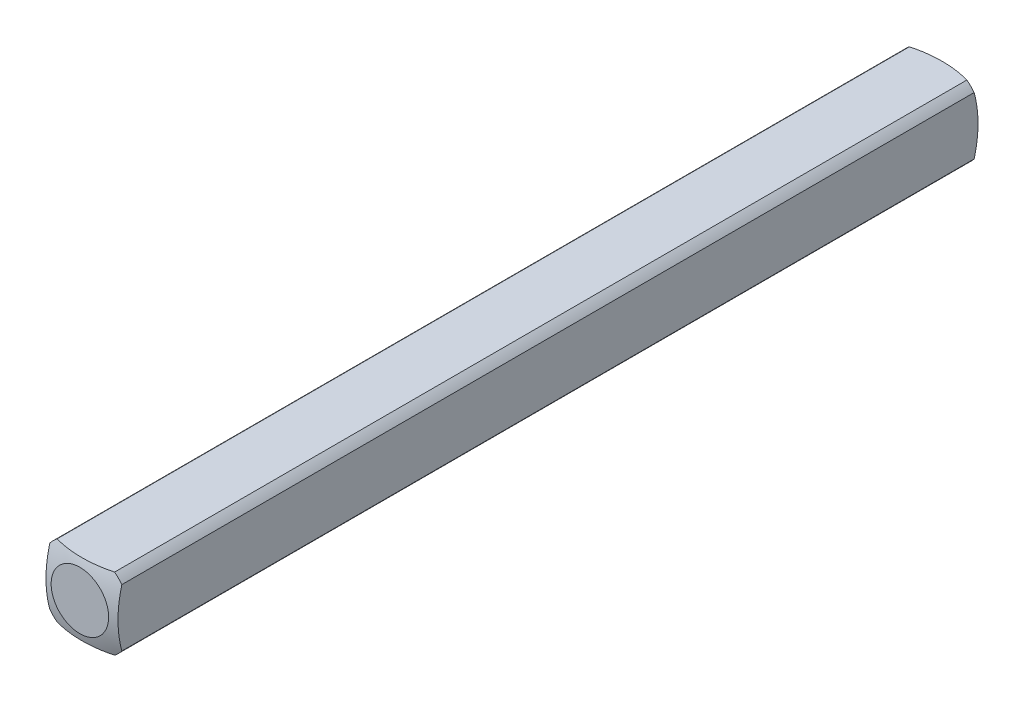
ISO-10303-21;
HEADER;
FILE_DESCRIPTION(('STEP AP214'),'2;1');
FILE_NAME('part.step','',(''),(''),'','','');
FILE_SCHEMA(('AUTOMOTIVE_DESIGN { 1 0 10303 214 1 1 1 1 }'));
ENDSEC;
DATA;
#1=APPLICATION_CONTEXT('core data for automotive mechanical design processes');
#2=APPLICATION_PROTOCOL_DEFINITION('international standard','automotive_design',2000,#1);
#3=PRODUCT_CONTEXT('',#1,'mechanical');
#4=PRODUCT('Part','Part','',(#3));
#5=PRODUCT_RELATED_PRODUCT_CATEGORY('part','',(#4));
#6=PRODUCT_DEFINITION_FORMATION('','',#4);
#7=PRODUCT_DEFINITION_CONTEXT('part definition',#1,'design');
#8=PRODUCT_DEFINITION('design','',#6,#7);
#9=PRODUCT_DEFINITION_SHAPE('','',#8);
#10=(LENGTH_UNIT() NAMED_UNIT(*) SI_UNIT(.MILLI.,.METRE.));
#11=(NAMED_UNIT(*) PLANE_ANGLE_UNIT() SI_UNIT($,.RADIAN.));
#12=(NAMED_UNIT(*) SI_UNIT($,.STERADIAN.) SOLID_ANGLE_UNIT());
#13=UNCERTAINTY_MEASURE_WITH_UNIT(LENGTH_MEASURE(1.E-05),#10,'distance_accuracy_value','');
#14=(GEOMETRIC_REPRESENTATION_CONTEXT(3) GLOBAL_UNCERTAINTY_ASSIGNED_CONTEXT((#13)) GLOBAL_UNIT_ASSIGNED_CONTEXT((#10,
#11,#12)) REPRESENTATION_CONTEXT('',''));
#15=CARTESIAN_POINT('',(0.,0.,0.));
#16=DIRECTION('',(0.,0.,1.));
#17=DIRECTION('',(1.,0.,0.));
#18=AXIS2_PLACEMENT_3D('',#15,#16,#17);
#19=CARTESIAN_POINT('',(-1.5875,-1.5875,19.05));
#20=DIRECTION('',(1.,0.,0.));
#21=DIRECTION('',(0.,0.,-1.));
#22=AXIS2_PLACEMENT_3D('',#19,#20,#21);
#23=PLANE('',#22);
#24=CARTESIAN_POINT('',(-1.5875,0.,4.91912226376204));
#25=DIRECTION('',(1.,0.,0.));
#26=DIRECTION('',(0.,0.,-1.));
#27=AXIS2_PLACEMENT_3D('',#24,#25,#26);
#28=CIRCLE('',#27,4.82558221875869);
#29=CARTESIAN_POINT('',(-1.5875,-1.26841150657032,0.263225357686905));
#30=VERTEX_POINT('',#29);
#31=CARTESIAN_POINT('',(-1.5875,1.26841150657032,0.263225357686917));
#32=VERTEX_POINT('',#31);
#33=EDGE_CURVE('E49',#30,#32,#28,.T.);
#34=ORIENTED_EDGE('',*,*,#33,.F.);
#35=DIRECTION('',(0.,0.,-1.));
#36=VECTOR('',#35,1.);
#37=CARTESIAN_POINT('',(-1.5875,-1.26841150657032,19.05));
#38=LINE('',#37,#36);
#39=CARTESIAN_POINT('',(-1.5875,-1.26841150657032,37.8367746423131));
#40=VERTEX_POINT('',#39);
#41=EDGE_CURVE('E42',#40,#30,#38,.T.);
#42=ORIENTED_EDGE('',*,*,#41,.F.);
#43=CARTESIAN_POINT('',(-1.5875,0.,33.180877736238));
#44=DIRECTION('',(-1.,0.,0.));
#45=DIRECTION('',(0.,0.,1.));
#46=AXIS2_PLACEMENT_3D('',#43,#44,#45);
#47=CIRCLE('',#46,4.82558221875869);
#48=CARTESIAN_POINT('',(-1.5875,1.26841150657032,37.8367746423131));
#49=VERTEX_POINT('',#48);
#50=EDGE_CURVE('E125',#40,#49,#47,.T.);
#51=ORIENTED_EDGE('',*,*,#50,.T.);
#52=DIRECTION('',(0.,0.,-1.));
#53=VECTOR('',#52,1.);
#54=CARTESIAN_POINT('',(-1.5875,1.26841150657032,19.05));
#55=LINE('',#54,#53);
#56=EDGE_CURVE('E113',#32,#49,#55,.F.);
#57=ORIENTED_EDGE('',*,*,#56,.F.);
#58=EDGE_LOOP('',(#34,#42,#51,#57));
#59=FACE_BOUND('',#58,.T.);
#60=ADVANCED_FACE('F35',(#59),#23,.F.);
#61=CARTESIAN_POINT('',(-1.5875,-1.5875,19.05));
#62=DIRECTION('',(0.,1.,0.));
#63=DIRECTION('',(0.,0.,1.));
#64=AXIS2_PLACEMENT_3D('',#61,#62,#63);
#65=PLANE('',#64);
#66=CARTESIAN_POINT('',(0.,-1.5875,4.91912226376204));
#67=DIRECTION('',(0.,1.,0.));
#68=DIRECTION('',(0.,0.,1.));
#69=AXIS2_PLACEMENT_3D('',#66,#67,#68);
#70=CIRCLE('',#69,4.82558221875869);
#71=CARTESIAN_POINT('',(1.26841150657032,-1.5875,0.263225357686905));
#72=VERTEX_POINT('',#71);
#73=CARTESIAN_POINT('',(-1.26841150657032,-1.5875,0.263225357686908));
#74=VERTEX_POINT('',#73);
#75=EDGE_CURVE('E154',#72,#74,#70,.T.);
#76=ORIENTED_EDGE('',*,*,#75,.F.);
#77=DIRECTION('',(0.,0.,-1.));
#78=VECTOR('',#77,1.);
#79=CARTESIAN_POINT('',(1.26841150657032,-1.5875,19.05));
#80=LINE('',#79,#78);
#81=CARTESIAN_POINT('',(1.26841150657032,-1.5875,37.8367746423131));
#82=VERTEX_POINT('',#81);
#83=EDGE_CURVE('E167',#82,#72,#80,.T.);
#84=ORIENTED_EDGE('',*,*,#83,.F.);
#85=CARTESIAN_POINT('',(0.,-1.5875,33.180877736238));
#86=DIRECTION('',(0.,-1.,0.));
#87=DIRECTION('',(0.,0.,-1.));
#88=AXIS2_PLACEMENT_3D('',#85,#86,#87);
#89=CIRCLE('',#88,4.82558221875869);
#90=CARTESIAN_POINT('',(-1.26841150657032,-1.5875,37.8367746423131));
#91=VERTEX_POINT('',#90);
#92=EDGE_CURVE('E136',#82,#91,#89,.T.);
#93=ORIENTED_EDGE('',*,*,#92,.T.);
#94=DIRECTION('',(0.,0.,-1.));
#95=VECTOR('',#94,1.);
#96=CARTESIAN_POINT('',(-1.26841150657032,-1.5875,19.05));
#97=LINE('',#96,#95);
#98=EDGE_CURVE('E165',#74,#91,#97,.F.);
#99=ORIENTED_EDGE('',*,*,#98,.F.);
#100=EDGE_LOOP('',(#76,#84,#93,#99));
#101=FACE_BOUND('',#100,.T.);
#102=ADVANCED_FACE('F177',(#101),#65,.F.);
#103=CARTESIAN_POINT('',(1.5875,-1.5875,19.05));
#104=DIRECTION('',(-1.,0.,0.));
#105=DIRECTION('',(0.,0.,1.));
#106=AXIS2_PLACEMENT_3D('',#103,#104,#105);
#107=PLANE('',#106);
#108=CARTESIAN_POINT('',(1.5875,0.,4.91912226376204));
#109=DIRECTION('',(-1.,0.,0.));
#110=DIRECTION('',(0.,0.,1.));
#111=AXIS2_PLACEMENT_3D('',#108,#109,#110);
#112=CIRCLE('',#111,4.82558221875869);
#113=CARTESIAN_POINT('',(1.5875,1.26841150657032,0.263225357686908));
#114=VERTEX_POINT('',#113);
#115=CARTESIAN_POINT('',(1.5875,-1.26841150657032,0.263225357686905));
#116=VERTEX_POINT('',#115);
#117=EDGE_CURVE('E152',#114,#116,#112,.T.);
#118=ORIENTED_EDGE('',*,*,#117,.F.);
#119=DIRECTION('',(0.,0.,-1.));
#120=VECTOR('',#119,1.);
#121=CARTESIAN_POINT('',(1.5875,1.26841150657032,19.05));
#122=LINE('',#121,#120);
#123=CARTESIAN_POINT('',(1.5875,1.26841150657032,37.8367746423131));
#124=VERTEX_POINT('',#123);
#125=EDGE_CURVE('E162',#124,#114,#122,.T.);
#126=ORIENTED_EDGE('',*,*,#125,.F.);
#127=CARTESIAN_POINT('',(1.5875,0.,33.180877736238));
#128=DIRECTION('',(1.,0.,0.));
#129=DIRECTION('',(0.,0.,-1.));
#130=AXIS2_PLACEMENT_3D('',#127,#128,#129);
#131=CIRCLE('',#130,4.82558221875869);
#132=CARTESIAN_POINT('',(1.5875,-1.26841150657032,37.8367746423131));
#133=VERTEX_POINT('',#132);
#134=EDGE_CURVE('E133',#124,#133,#131,.T.);
#135=ORIENTED_EDGE('',*,*,#134,.T.);
#136=DIRECTION('',(0.,0.,-1.));
#137=VECTOR('',#136,1.);
#138=CARTESIAN_POINT('',(1.5875,-1.26841150657032,19.05));
#139=LINE('',#138,#137);
#140=EDGE_CURVE('E106',#116,#133,#139,.F.);
#141=ORIENTED_EDGE('',*,*,#140,.F.);
#142=EDGE_LOOP('',(#118,#126,#135,#141));
#143=FACE_BOUND('',#142,.T.);
#144=ADVANCED_FACE('F184',(#143),#107,.F.);
#145=CARTESIAN_POINT('',(-1.5875,1.5875,19.05));
#146=DIRECTION('',(0.,-1.,0.));
#147=DIRECTION('',(0.,0.,-1.));
#148=AXIS2_PLACEMENT_3D('',#145,#146,#147);
#149=PLANE('',#148);
#150=CARTESIAN_POINT('',(0.,1.5875,4.91912226376204));
#151=DIRECTION('',(0.,-1.,0.));
#152=DIRECTION('',(0.,0.,-1.));
#153=AXIS2_PLACEMENT_3D('',#150,#151,#152);
#154=CIRCLE('',#153,4.82558221875869);
#155=CARTESIAN_POINT('',(-1.26841150657032,1.5875,0.263225357686908));
#156=VERTEX_POINT('',#155);
#157=CARTESIAN_POINT('',(1.26841150657032,1.5875,0.263225357686905));
#158=VERTEX_POINT('',#157);
#159=EDGE_CURVE('E104',#156,#158,#154,.T.);
#160=ORIENTED_EDGE('',*,*,#159,.F.);
#161=DIRECTION('',(0.,0.,-1.));
#162=VECTOR('',#161,1.);
#163=CARTESIAN_POINT('',(-1.26841150657032,1.5875,19.05));
#164=LINE('',#163,#162);
#165=CARTESIAN_POINT('',(-1.26841150657032,1.5875,37.8367746423131));
#166=VERTEX_POINT('',#165);
#167=EDGE_CURVE('E98',#166,#156,#164,.T.);
#168=ORIENTED_EDGE('',*,*,#167,.F.);
#169=CARTESIAN_POINT('',(0.,1.5875,33.180877736238));
#170=DIRECTION('',(0.,1.,0.));
#171=DIRECTION('',(0.,0.,1.));
#172=AXIS2_PLACEMENT_3D('',#169,#170,#171);
#173=CIRCLE('',#172,4.82558221875869);
#174=CARTESIAN_POINT('',(1.26841150657032,1.5875,37.8367746423131));
#175=VERTEX_POINT('',#174);
#176=EDGE_CURVE('E103',#166,#175,#173,.T.);
#177=ORIENTED_EDGE('',*,*,#176,.T.);
#178=DIRECTION('',(0.,0.,-1.));
#179=VECTOR('',#178,1.);
#180=CARTESIAN_POINT('',(1.26841150657032,1.5875,19.05));
#181=LINE('',#180,#179);
#182=EDGE_CURVE('E107',#158,#175,#181,.F.);
#183=ORIENTED_EDGE('',*,*,#182,.F.);
#184=EDGE_LOOP('',(#160,#168,#177,#183));
#185=FACE_BOUND('',#184,.T.);
#186=ADVANCED_FACE('F100',(#185),#149,.F.);
#187=CARTESIAN_POINT('',(0.,0.,19.05));
#188=DIRECTION('',(0.,0.,-1.));
#189=DIRECTION('',(-1.,0.,0.));
#190=AXIS2_PLACEMENT_3D('',#187,#188,#189);
#191=CYLINDRICAL_SURFACE('',#190,2.032);
#192=ORIENTED_EDGE('',*,*,#41,.T.);
#193=CARTESIAN_POINT('',(0.,0.,0.263225357686908));
#194=DIRECTION('',(0.,0.,1.));
#195=DIRECTION('',(1.,0.,0.));
#196=AXIS2_PLACEMENT_3D('',#193,#194,#195);
#197=CIRCLE('',#196,2.032);
#198=EDGE_CURVE('E149',#30,#74,#197,.T.);
#199=ORIENTED_EDGE('',*,*,#198,.T.);
#200=ORIENTED_EDGE('',*,*,#98,.T.);
#201=CARTESIAN_POINT('',(0.,0.,37.8367746423131));
#202=DIRECTION('',(0.,0.,1.));
#203=DIRECTION('',(1.,0.,0.));
#204=AXIS2_PLACEMENT_3D('',#201,#202,#203);
#205=CIRCLE('',#204,2.032);
#206=EDGE_CURVE('E130',#40,#91,#205,.T.);
#207=ORIENTED_EDGE('',*,*,#206,.F.);
#208=EDGE_LOOP('',(#192,#199,#200,#207));
#209=FACE_BOUND('',#208,.T.);
#210=ADVANCED_FACE('F173',(#209),#191,.T.);
#211=ORIENTED_EDGE('',*,*,#83,.T.);
#212=CARTESIAN_POINT('',(0.,0.,0.263225357686908));
#213=DIRECTION('',(0.,0.,1.));
#214=DIRECTION('',(1.,0.,0.));
#215=AXIS2_PLACEMENT_3D('',#212,#213,#214);
#216=CIRCLE('',#215,2.032);
#217=EDGE_CURVE('E55',#72,#116,#216,.T.);
#218=ORIENTED_EDGE('',*,*,#217,.T.);
#219=ORIENTED_EDGE('',*,*,#140,.T.);
#220=CARTESIAN_POINT('',(0.,0.,37.8367746423131));
#221=DIRECTION('',(0.,0.,1.));
#222=DIRECTION('',(1.,0.,0.));
#223=AXIS2_PLACEMENT_3D('',#220,#221,#222);
#224=CIRCLE('',#223,2.032);
#225=EDGE_CURVE('E139',#82,#133,#224,.T.);
#226=ORIENTED_EDGE('',*,*,#225,.F.);
#227=EDGE_LOOP('',(#211,#218,#219,#226));
#228=FACE_BOUND('',#227,.T.);
#229=ADVANCED_FACE('F180',(#228),#191,.T.);
#230=ORIENTED_EDGE('',*,*,#125,.T.);
#231=CARTESIAN_POINT('',(0.,0.,0.263225357686908));
#232=DIRECTION('',(0.,0.,1.));
#233=DIRECTION('',(1.,0.,0.));
#234=AXIS2_PLACEMENT_3D('',#231,#232,#233);
#235=CIRCLE('',#234,2.032);
#236=EDGE_CURVE('E146',#114,#158,#235,.T.);
#237=ORIENTED_EDGE('',*,*,#236,.T.);
#238=ORIENTED_EDGE('',*,*,#182,.T.);
#239=CARTESIAN_POINT('',(0.,0.,37.8367746423131));
#240=DIRECTION('',(0.,0.,1.));
#241=DIRECTION('',(1.,0.,0.));
#242=AXIS2_PLACEMENT_3D('',#239,#240,#241);
#243=CIRCLE('',#242,2.032);
#244=EDGE_CURVE('E124',#124,#175,#243,.T.);
#245=ORIENTED_EDGE('',*,*,#244,.F.);
#246=EDGE_LOOP('',(#230,#237,#238,#245));
#247=FACE_BOUND('',#246,.T.);
#248=ADVANCED_FACE('F186',(#247),#191,.T.);
#249=ORIENTED_EDGE('',*,*,#167,.T.);
#250=CARTESIAN_POINT('',(0.,0.,0.263225357686908));
#251=DIRECTION('',(0.,0.,1.));
#252=DIRECTION('',(1.,0.,0.));
#253=AXIS2_PLACEMENT_3D('',#250,#251,#252);
#254=CIRCLE('',#253,2.032);
#255=EDGE_CURVE('E12',#156,#32,#254,.T.);
#256=ORIENTED_EDGE('',*,*,#255,.T.);
#257=ORIENTED_EDGE('',*,*,#56,.T.);
#258=CARTESIAN_POINT('',(0.,0.,37.8367746423131));
#259=DIRECTION('',(0.,0.,1.));
#260=DIRECTION('',(1.,0.,0.));
#261=AXIS2_PLACEMENT_3D('',#258,#259,#260);
#262=CIRCLE('',#261,2.032);
#263=EDGE_CURVE('E110',#166,#49,#262,.T.);
#264=ORIENTED_EDGE('',*,*,#263,.F.);
#265=EDGE_LOOP('',(#249,#256,#257,#264));
#266=FACE_BOUND('',#265,.T.);
#267=ADVANCED_FACE('F111',(#266),#191,.T.);
#268=CARTESIAN_POINT('',(0.,0.,4.91912226376204));
#269=DIRECTION('',(0.,0.,1.));
#270=DIRECTION('',(-1.,0.,0.));
#271=AXIS2_PLACEMENT_3D('',#268,#269,#270);
#272=SPHERICAL_SURFACE('',#271,5.08);
#273=CARTESIAN_POINT('',(0.,0.,0.));
#274=DIRECTION('',(0.,0.,-1.));
#275=DIRECTION('',(-1.,0.,0.));
#276=AXIS2_PLACEMENT_3D('',#273,#274,#275);
#277=CIRCLE('',#276,1.26832020963187);
#278=CARTESIAN_POINT('',(-1.26832020963187,0.,0.));
#279=VERTEX_POINT('',#278);
#280=EDGE_CURVE('E157',#279,#279,#277,.T.);
#281=ORIENTED_EDGE('',*,*,#280,.F.);
#282=EDGE_LOOP('',(#281));
#283=FACE_BOUND('',#282,.T.);
#284=ORIENTED_EDGE('',*,*,#75,.T.);
#285=ORIENTED_EDGE('',*,*,#198,.F.);
#286=ORIENTED_EDGE('',*,*,#33,.T.);
#287=ORIENTED_EDGE('',*,*,#255,.F.);
#288=ORIENTED_EDGE('',*,*,#159,.T.);
#289=ORIENTED_EDGE('',*,*,#236,.F.);
#290=ORIENTED_EDGE('',*,*,#117,.T.);
#291=ORIENTED_EDGE('',*,*,#217,.F.);
#292=EDGE_LOOP('',(#284,#285,#286,#287,#288,#289,#290,#291));
#293=FACE_BOUND('',#292,.T.);
#294=ADVANCED_FACE('F187',(#283,#293),#272,.T.);
#295=CARTESIAN_POINT('',(0.,0.,0.));
#296=DIRECTION('',(0.,0.,-1.));
#297=DIRECTION('',(-1.,0.,0.));
#298=AXIS2_PLACEMENT_3D('',#295,#296,#297);
#299=PLANE('',#298);
#300=ORIENTED_EDGE('',*,*,#280,.T.);
#301=EDGE_LOOP('',(#300));
#302=FACE_BOUND('',#301,.T.);
#303=ADVANCED_FACE('F189',(#302),#299,.T.);
#304=CARTESIAN_POINT('',(0.,0.,33.180877736238));
#305=DIRECTION('',(0.,0.,-1.));
#306=DIRECTION('',(-1.,0.,0.));
#307=AXIS2_PLACEMENT_3D('',#304,#305,#306);
#308=SPHERICAL_SURFACE('',#307,5.08);
#309=CARTESIAN_POINT('',(0.,0.,38.1));
#310=DIRECTION('',(0.,0.,-1.));
#311=DIRECTION('',(-1.,0.,0.));
#312=AXIS2_PLACEMENT_3D('',#309,#310,#311);
#313=CIRCLE('',#312,1.26832020963187);
#314=CARTESIAN_POINT('',(-1.26832020963187,0.,38.1));
#315=VERTEX_POINT('',#314);
#316=EDGE_CURVE('E117',#315,#315,#313,.T.);
#317=ORIENTED_EDGE('',*,*,#316,.T.);
#318=EDGE_LOOP('',(#317));
#319=FACE_BOUND('',#318,.T.);
#320=ORIENTED_EDGE('',*,*,#92,.F.);
#321=ORIENTED_EDGE('',*,*,#225,.T.);
#322=ORIENTED_EDGE('',*,*,#134,.F.);
#323=ORIENTED_EDGE('',*,*,#244,.T.);
#324=ORIENTED_EDGE('',*,*,#176,.F.);
#325=ORIENTED_EDGE('',*,*,#263,.T.);
#326=ORIENTED_EDGE('',*,*,#50,.F.);
#327=ORIENTED_EDGE('',*,*,#206,.T.);
#328=EDGE_LOOP('',(#320,#321,#322,#323,#324,#325,#326,#327));
#329=FACE_BOUND('',#328,.T.);
#330=ADVANCED_FACE('F121',(#319,#329),#308,.T.);
#331=CARTESIAN_POINT('',(0.,0.,38.1));
#332=DIRECTION('',(0.,0.,1.));
#333=DIRECTION('',(-1.,0.,0.));
#334=AXIS2_PLACEMENT_3D('',#331,#332,#333);
#335=PLANE('',#334);
#336=ORIENTED_EDGE('',*,*,#316,.F.);
#337=EDGE_LOOP('',(#336));
#338=FACE_BOUND('',#337,.T.);
#339=ADVANCED_FACE('F234',(#338),#335,.T.);
#340=CLOSED_SHELL('',(#60,#102,#144,#186,#210,#229,#248,#267,#294,#303,#330,#339));
#341=MANIFOLD_SOLID_BREP('B2',#340);
#342=ADVANCED_BREP_SHAPE_REPRESENTATION('',(#18,#341),#14);
#343=SHAPE_DEFINITION_REPRESENTATION(#9,#342);
ENDSEC;
END-ISO-10303-21;
